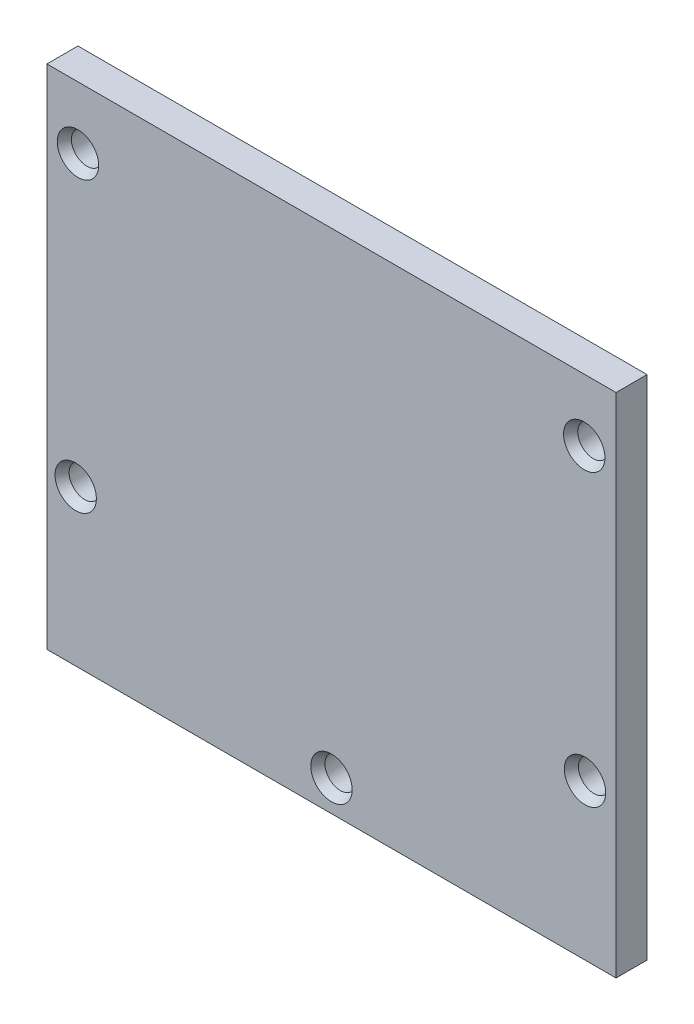
ISO-10303-21;
HEADER;
FILE_DESCRIPTION(('STEP AP214'),'2;1');
FILE_NAME('part.step','',(''),(''),'','','');
FILE_SCHEMA(('AUTOMOTIVE_DESIGN { 1 0 10303 214 1 1 1 1 }'));
ENDSEC;
DATA;
#1=APPLICATION_CONTEXT('core data for automotive mechanical design processes');
#2=APPLICATION_PROTOCOL_DEFINITION('international standard','automotive_design',2000,#1);
#3=PRODUCT_CONTEXT('',#1,'mechanical');
#4=PRODUCT('Part','Part','',(#3));
#5=PRODUCT_RELATED_PRODUCT_CATEGORY('part','',(#4));
#6=PRODUCT_DEFINITION_FORMATION('','',#4);
#7=PRODUCT_DEFINITION_CONTEXT('part definition',#1,'design');
#8=PRODUCT_DEFINITION('design','',#6,#7);
#9=PRODUCT_DEFINITION_SHAPE('','',#8);
#10=(LENGTH_UNIT() NAMED_UNIT(*) SI_UNIT(.MILLI.,.METRE.));
#11=(NAMED_UNIT(*) PLANE_ANGLE_UNIT() SI_UNIT($,.RADIAN.));
#12=(NAMED_UNIT(*) SI_UNIT($,.STERADIAN.) SOLID_ANGLE_UNIT());
#13=UNCERTAINTY_MEASURE_WITH_UNIT(LENGTH_MEASURE(1.E-05),#10,'distance_accuracy_value','');
#14=(GEOMETRIC_REPRESENTATION_CONTEXT(3) GLOBAL_UNCERTAINTY_ASSIGNED_CONTEXT((#13)) GLOBAL_UNIT_ASSIGNED_CONTEXT((#10,
#11,#12)) REPRESENTATION_CONTEXT('',''));
#15=CARTESIAN_POINT('',(0.,0.,0.));
#16=DIRECTION('',(0.,0.,1.));
#17=DIRECTION('',(1.,0.,0.));
#18=AXIS2_PLACEMENT_3D('',#15,#16,#17);
#19=CARTESIAN_POINT('',(0.,0.,3.));
#20=DIRECTION('',(0.,0.,-1.));
#21=DIRECTION('',(-1.,0.,0.));
#22=AXIS2_PLACEMENT_3D('',#19,#20,#21);
#23=PLANE('',#22);
#24=CARTESIAN_POINT('',(-24.7186538698167,-12.5,3.));
#25=DIRECTION('',(0.,0.,-1.));
#26=DIRECTION('',(-1.,0.,0.));
#27=AXIS2_PLACEMENT_3D('',#24,#25,#26);
#28=CIRCLE('',#27,1.99999999999999);
#29=CARTESIAN_POINT('',(-26.7186538698167,-12.5,3.));
#30=VERTEX_POINT('',#29);
#31=EDGE_CURVE('E128',#30,#30,#28,.T.);
#32=ORIENTED_EDGE('',*,*,#31,.T.);
#33=EDGE_LOOP('',(#32));
#34=FACE_BOUND('',#33,.T.);
#35=CARTESIAN_POINT('',(0.,-24.5,3.));
#36=DIRECTION('',(0.,0.,-1.));
#37=DIRECTION('',(-1.,0.,0.));
#38=AXIS2_PLACEMENT_3D('',#35,#36,#37);
#39=CIRCLE('',#38,1.99999999999999);
#40=CARTESIAN_POINT('',(-1.99999999999999,-24.5,3.));
#41=VERTEX_POINT('',#40);
#42=EDGE_CURVE('E125',#41,#41,#39,.T.);
#43=ORIENTED_EDGE('',*,*,#42,.T.);
#44=EDGE_LOOP('',(#43));
#45=FACE_BOUND('',#44,.T.);
#46=CARTESIAN_POINT('',(-24.5,15.5,3.));
#47=DIRECTION('',(0.,0.,-1.));
#48=DIRECTION('',(-1.,0.,0.));
#49=AXIS2_PLACEMENT_3D('',#46,#47,#48);
#50=CIRCLE('',#49,1.99999999999999);
#51=CARTESIAN_POINT('',(-26.5,15.5,3.));
#52=VERTEX_POINT('',#51);
#53=EDGE_CURVE('E122',#52,#52,#50,.T.);
#54=ORIENTED_EDGE('',*,*,#53,.T.);
#55=EDGE_LOOP('',(#54));
#56=FACE_BOUND('',#55,.T.);
#57=CARTESIAN_POINT('',(24.5,-12.5,3.));
#58=DIRECTION('',(0.,0.,-1.));
#59=DIRECTION('',(-1.,0.,0.));
#60=AXIS2_PLACEMENT_3D('',#57,#58,#59);
#61=CIRCLE('',#60,1.99999999999999);
#62=CARTESIAN_POINT('',(22.5,-12.5,3.));
#63=VERTEX_POINT('',#62);
#64=EDGE_CURVE('E119',#63,#63,#61,.T.);
#65=ORIENTED_EDGE('',*,*,#64,.T.);
#66=EDGE_LOOP('',(#65));
#67=FACE_BOUND('',#66,.T.);
#68=CARTESIAN_POINT('',(24.4303500117454,15.5,3.));
#69=DIRECTION('',(0.,0.,-1.));
#70=DIRECTION('',(-1.,0.,0.));
#71=AXIS2_PLACEMENT_3D('',#68,#69,#70);
#72=CIRCLE('',#71,1.99999999999999);
#73=CARTESIAN_POINT('',(22.4303500117454,15.5,3.));
#74=VERTEX_POINT('',#73);
#75=EDGE_CURVE('E116',#74,#74,#72,.T.);
#76=ORIENTED_EDGE('',*,*,#75,.T.);
#77=EDGE_LOOP('',(#76));
#78=FACE_BOUND('',#77,.T.);
#79=DIRECTION('',(0.,-1.,0.));
#80=VECTOR('',#79,1.);
#81=CARTESIAN_POINT('',(-27.5,-27.5,3.));
#82=LINE('',#81,#80);
#83=CARTESIAN_POINT('',(-27.5,21.5,3.));
#84=VERTEX_POINT('',#83);
#85=CARTESIAN_POINT('',(-27.5,-27.5,3.));
#86=VERTEX_POINT('',#85);
#87=EDGE_CURVE('E88',#84,#86,#82,.T.);
#88=ORIENTED_EDGE('',*,*,#87,.T.);
#89=DIRECTION('',(1.,0.,0.));
#90=VECTOR('',#89,1.);
#91=CARTESIAN_POINT('',(-27.5,-27.5,3.));
#92=LINE('',#91,#90);
#93=CARTESIAN_POINT('',(27.5,-27.5,3.));
#94=VERTEX_POINT('',#93);
#95=EDGE_CURVE('E84',#86,#94,#92,.T.);
#96=ORIENTED_EDGE('',*,*,#95,.T.);
#97=DIRECTION('',(0.,1.,0.));
#98=VECTOR('',#97,1.);
#99=CARTESIAN_POINT('',(27.5,-27.5,3.));
#100=LINE('',#99,#98);
#101=CARTESIAN_POINT('',(27.5,21.5,3.));
#102=VERTEX_POINT('',#101);
#103=EDGE_CURVE('E86',#94,#102,#100,.T.);
#104=ORIENTED_EDGE('',*,*,#103,.T.);
#105=DIRECTION('',(-1.,0.,0.));
#106=VECTOR('',#105,1.);
#107=CARTESIAN_POINT('',(-27.5,21.5,3.));
#108=LINE('',#107,#106);
#109=EDGE_CURVE('E53',#102,#84,#108,.T.);
#110=ORIENTED_EDGE('',*,*,#109,.T.);
#111=EDGE_LOOP('',(#88,#96,#104,#110));
#112=FACE_BOUND('',#111,.T.);
#113=ADVANCED_FACE('F35',(#34,#45,#56,#67,#78,#112),#23,.F.);
#114=CARTESIAN_POINT('',(0.,0.,0.));
#115=DIRECTION('',(0.,0.,-1.));
#116=DIRECTION('',(-1.,0.,0.));
#117=AXIS2_PLACEMENT_3D('',#114,#115,#116);
#118=PLANE('',#117);
#119=CARTESIAN_POINT('',(24.4303500117454,15.5,0.));
#120=DIRECTION('',(0.,0.,1.));
#121=DIRECTION('',(1.,0.,0.));
#122=AXIS2_PLACEMENT_3D('',#119,#120,#121);
#123=CIRCLE('',#122,1.5);
#124=CARTESIAN_POINT('',(25.9303500117454,15.5,0.));
#125=VERTEX_POINT('',#124);
#126=EDGE_CURVE('E215',#125,#125,#123,.T.);
#127=ORIENTED_EDGE('',*,*,#126,.T.);
#128=EDGE_LOOP('',(#127));
#129=FACE_BOUND('',#128,.T.);
#130=CARTESIAN_POINT('',(-24.7186538698167,-12.5,0.));
#131=DIRECTION('',(0.,0.,1.));
#132=DIRECTION('',(1.,0.,0.));
#133=AXIS2_PLACEMENT_3D('',#130,#131,#132);
#134=CIRCLE('',#133,1.5);
#135=CARTESIAN_POINT('',(-23.2186538698167,-12.5,0.));
#136=VERTEX_POINT('',#135);
#137=EDGE_CURVE('E223',#136,#136,#134,.T.);
#138=ORIENTED_EDGE('',*,*,#137,.T.);
#139=EDGE_LOOP('',(#138));
#140=FACE_BOUND('',#139,.T.);
#141=DIRECTION('',(0.,-1.,0.));
#142=VECTOR('',#141,1.);
#143=CARTESIAN_POINT('',(-27.5,-27.5,0.));
#144=LINE('',#143,#142);
#145=CARTESIAN_POINT('',(-27.5,21.5,0.));
#146=VERTEX_POINT('',#145);
#147=CARTESIAN_POINT('',(-27.5,-27.5,0.));
#148=VERTEX_POINT('',#147);
#149=EDGE_CURVE('E103',#146,#148,#144,.T.);
#150=ORIENTED_EDGE('',*,*,#149,.F.);
#151=DIRECTION('',(-1.,0.,0.));
#152=VECTOR('',#151,1.);
#153=CARTESIAN_POINT('',(-27.5,21.5,0.));
#154=LINE('',#153,#152);
#155=CARTESIAN_POINT('',(27.5,21.5,0.));
#156=VERTEX_POINT('',#155);
#157=EDGE_CURVE('E76',#156,#146,#154,.T.);
#158=ORIENTED_EDGE('',*,*,#157,.F.);
#159=DIRECTION('',(0.,1.,0.));
#160=VECTOR('',#159,1.);
#161=CARTESIAN_POINT('',(27.5,-27.5,0.));
#162=LINE('',#161,#160);
#163=CARTESIAN_POINT('',(27.5,-27.5,0.));
#164=VERTEX_POINT('',#163);
#165=EDGE_CURVE('E70',#164,#156,#162,.T.);
#166=ORIENTED_EDGE('',*,*,#165,.F.);
#167=DIRECTION('',(1.,0.,0.));
#168=VECTOR('',#167,1.);
#169=CARTESIAN_POINT('',(-27.5,-27.5,0.));
#170=LINE('',#169,#168);
#171=EDGE_CURVE('E93',#148,#164,#170,.T.);
#172=ORIENTED_EDGE('',*,*,#171,.F.);
#173=EDGE_LOOP('',(#150,#158,#166,#172));
#174=FACE_BOUND('',#173,.T.);
#175=CARTESIAN_POINT('',(-24.5,15.5,0.));
#176=DIRECTION('',(0.,0.,1.));
#177=DIRECTION('',(1.,0.,0.));
#178=AXIS2_PLACEMENT_3D('',#175,#176,#177);
#179=CIRCLE('',#178,1.5);
#180=CARTESIAN_POINT('',(-23.,15.5,0.));
#181=VERTEX_POINT('',#180);
#182=EDGE_CURVE('E106',#181,#181,#179,.T.);
#183=ORIENTED_EDGE('',*,*,#182,.T.);
#184=EDGE_LOOP('',(#183));
#185=FACE_BOUND('',#184,.T.);
#186=CARTESIAN_POINT('',(24.5,-12.5,0.));
#187=DIRECTION('',(0.,0.,1.));
#188=DIRECTION('',(1.,0.,0.));
#189=AXIS2_PLACEMENT_3D('',#186,#187,#188);
#190=CIRCLE('',#189,1.5);
#191=CARTESIAN_POINT('',(26.,-12.5,0.));
#192=VERTEX_POINT('',#191);
#193=EDGE_CURVE('E218',#192,#192,#190,.T.);
#194=ORIENTED_EDGE('',*,*,#193,.T.);
#195=EDGE_LOOP('',(#194));
#196=FACE_BOUND('',#195,.T.);
#197=CARTESIAN_POINT('',(0.,-24.5,0.));
#198=DIRECTION('',(0.,0.,1.));
#199=DIRECTION('',(1.,0.,0.));
#200=AXIS2_PLACEMENT_3D('',#197,#198,#199);
#201=CIRCLE('',#200,1.5);
#202=CARTESIAN_POINT('',(1.5,-24.5,0.));
#203=VERTEX_POINT('',#202);
#204=EDGE_CURVE('E213',#203,#203,#201,.T.);
#205=ORIENTED_EDGE('',*,*,#204,.T.);
#206=EDGE_LOOP('',(#205));
#207=FACE_BOUND('',#206,.T.);
#208=ADVANCED_FACE('F157',(#129,#140,#174,#185,#196,#207),#118,.T.);
#209=CARTESIAN_POINT('',(-27.5,-27.5,3.));
#210=DIRECTION('',(1.,0.,0.));
#211=DIRECTION('',(0.,0.,-1.));
#212=AXIS2_PLACEMENT_3D('',#209,#210,#211);
#213=PLANE('',#212);
#214=ORIENTED_EDGE('',*,*,#149,.T.);
#215=DIRECTION('',(0.,0.,-1.));
#216=VECTOR('',#215,1.);
#217=CARTESIAN_POINT('',(-27.5,-27.5,3.));
#218=LINE('',#217,#216);
#219=EDGE_CURVE('E94',#86,#148,#218,.T.);
#220=ORIENTED_EDGE('',*,*,#219,.F.);
#221=ORIENTED_EDGE('',*,*,#87,.F.);
#222=DIRECTION('',(0.,0.,-1.));
#223=VECTOR('',#222,1.);
#224=CARTESIAN_POINT('',(-27.5,21.5,3.));
#225=LINE('',#224,#223);
#226=EDGE_CURVE('E99',#84,#146,#225,.T.);
#227=ORIENTED_EDGE('',*,*,#226,.T.);
#228=EDGE_LOOP('',(#214,#220,#221,#227));
#229=FACE_BOUND('',#228,.T.);
#230=ADVANCED_FACE('F163',(#229),#213,.F.);
#231=CARTESIAN_POINT('',(-27.5,-27.5,3.));
#232=DIRECTION('',(0.,1.,0.));
#233=DIRECTION('',(0.,0.,1.));
#234=AXIS2_PLACEMENT_3D('',#231,#232,#233);
#235=PLANE('',#234);
#236=ORIENTED_EDGE('',*,*,#171,.T.);
#237=DIRECTION('',(0.,0.,-1.));
#238=VECTOR('',#237,1.);
#239=CARTESIAN_POINT('',(27.5,-27.5,3.));
#240=LINE('',#239,#238);
#241=EDGE_CURVE('E91',#94,#164,#240,.T.);
#242=ORIENTED_EDGE('',*,*,#241,.F.);
#243=ORIENTED_EDGE('',*,*,#95,.F.);
#244=ORIENTED_EDGE('',*,*,#219,.T.);
#245=EDGE_LOOP('',(#236,#242,#243,#244));
#246=FACE_BOUND('',#245,.T.);
#247=ADVANCED_FACE('F92',(#246),#235,.F.);
#248=CARTESIAN_POINT('',(27.5,-27.5,3.));
#249=DIRECTION('',(-1.,0.,0.));
#250=DIRECTION('',(0.,0.,1.));
#251=AXIS2_PLACEMENT_3D('',#248,#249,#250);
#252=PLANE('',#251);
#253=ORIENTED_EDGE('',*,*,#165,.T.);
#254=DIRECTION('',(0.,0.,-1.));
#255=VECTOR('',#254,1.);
#256=CARTESIAN_POINT('',(27.5,21.5,3.));
#257=LINE('',#256,#255);
#258=EDGE_CURVE('E95',#102,#156,#257,.T.);
#259=ORIENTED_EDGE('',*,*,#258,.F.);
#260=ORIENTED_EDGE('',*,*,#103,.F.);
#261=ORIENTED_EDGE('',*,*,#241,.T.);
#262=EDGE_LOOP('',(#253,#259,#260,#261));
#263=FACE_BOUND('',#262,.T.);
#264=ADVANCED_FACE('F97',(#263),#252,.F.);
#265=CARTESIAN_POINT('',(-27.5,21.5,3.));
#266=DIRECTION('',(0.,-1.,0.));
#267=DIRECTION('',(0.,0.,-1.));
#268=AXIS2_PLACEMENT_3D('',#265,#266,#267);
#269=PLANE('',#268);
#270=ORIENTED_EDGE('',*,*,#157,.T.);
#271=ORIENTED_EDGE('',*,*,#226,.F.);
#272=ORIENTED_EDGE('',*,*,#109,.F.);
#273=ORIENTED_EDGE('',*,*,#258,.T.);
#274=EDGE_LOOP('',(#270,#271,#272,#273));
#275=FACE_BOUND('',#274,.T.);
#276=ADVANCED_FACE('F171',(#275),#269,.F.);
#277=CARTESIAN_POINT('',(-24.5,15.5,3.));
#278=DIRECTION('',(0.,0.,-1.));
#279=DIRECTION('',(-1.,0.,0.));
#280=AXIS2_PLACEMENT_3D('',#277,#278,#279);
#281=CYLINDRICAL_SURFACE('',#280,1.5);
#282=CARTESIAN_POINT('',(-24.5,15.5,2.13397459621557));
#283=DIRECTION('',(0.,0.,-1.));
#284=DIRECTION('',(-1.,0.,0.));
#285=AXIS2_PLACEMENT_3D('',#282,#283,#284);
#286=CIRCLE('',#285,1.5);
#287=CARTESIAN_POINT('',(-26.,15.5,2.13397459621557));
#288=VERTEX_POINT('',#287);
#289=EDGE_CURVE('E134',#288,#288,#286,.F.);
#290=ORIENTED_EDGE('',*,*,#289,.T.);
#291=EDGE_LOOP('',(#290));
#292=FACE_BOUND('',#291,.T.);
#293=ORIENTED_EDGE('',*,*,#182,.F.);
#294=EDGE_LOOP('',(#293));
#295=FACE_BOUND('',#294,.T.);
#296=ADVANCED_FACE('F168',(#292,#295),#281,.F.);
#297=CARTESIAN_POINT('',(-24.7186538698167,-12.5,3.));
#298=DIRECTION('',(0.,0.,-1.));
#299=DIRECTION('',(-1.,0.,0.));
#300=AXIS2_PLACEMENT_3D('',#297,#298,#299);
#301=CYLINDRICAL_SURFACE('',#300,1.5);
#302=CARTESIAN_POINT('',(-24.7186538698167,-12.5,2.13397459621557));
#303=DIRECTION('',(0.,0.,-1.));
#304=DIRECTION('',(-1.,0.,0.));
#305=AXIS2_PLACEMENT_3D('',#302,#303,#304);
#306=CIRCLE('',#305,1.5);
#307=CARTESIAN_POINT('',(-26.2186538698167,-12.5,2.13397459621557));
#308=VERTEX_POINT('',#307);
#309=EDGE_CURVE('E113',#308,#308,#306,.F.);
#310=ORIENTED_EDGE('',*,*,#309,.T.);
#311=EDGE_LOOP('',(#310));
#312=FACE_BOUND('',#311,.T.);
#313=ORIENTED_EDGE('',*,*,#137,.F.);
#314=EDGE_LOOP('',(#313));
#315=FACE_BOUND('',#314,.T.);
#316=ADVANCED_FACE('F232',(#312,#315),#301,.F.);
#317=CARTESIAN_POINT('',(24.5,-12.5,3.));
#318=DIRECTION('',(0.,0.,-1.));
#319=DIRECTION('',(-1.,0.,0.));
#320=AXIS2_PLACEMENT_3D('',#317,#318,#319);
#321=CYLINDRICAL_SURFACE('',#320,1.5);
#322=CARTESIAN_POINT('',(24.5,-12.5,2.13397459621557));
#323=DIRECTION('',(0.,0.,-1.));
#324=DIRECTION('',(-1.,0.,0.));
#325=AXIS2_PLACEMENT_3D('',#322,#323,#324);
#326=CIRCLE('',#325,1.5);
#327=CARTESIAN_POINT('',(23.,-12.5,2.13397459621557));
#328=VERTEX_POINT('',#327);
#329=EDGE_CURVE('E45',#328,#328,#326,.F.);
#330=ORIENTED_EDGE('',*,*,#329,.T.);
#331=EDGE_LOOP('',(#330));
#332=FACE_BOUND('',#331,.T.);
#333=ORIENTED_EDGE('',*,*,#193,.F.);
#334=EDGE_LOOP('',(#333));
#335=FACE_BOUND('',#334,.T.);
#336=ADVANCED_FACE('F139',(#332,#335),#321,.F.);
#337=CARTESIAN_POINT('',(24.4303500117454,15.5,3.));
#338=DIRECTION('',(0.,0.,-1.));
#339=DIRECTION('',(-1.,0.,0.));
#340=AXIS2_PLACEMENT_3D('',#337,#338,#339);
#341=CYLINDRICAL_SURFACE('',#340,1.5);
#342=CARTESIAN_POINT('',(24.4303500117454,15.5,2.13397459621557));
#343=DIRECTION('',(0.,0.,-1.));
#344=DIRECTION('',(-1.,0.,0.));
#345=AXIS2_PLACEMENT_3D('',#342,#343,#344);
#346=CIRCLE('',#345,1.5);
#347=CARTESIAN_POINT('',(22.9303500117454,15.5,2.13397459621557));
#348=VERTEX_POINT('',#347);
#349=EDGE_CURVE('E11',#348,#348,#346,.F.);
#350=ORIENTED_EDGE('',*,*,#349,.T.);
#351=EDGE_LOOP('',(#350));
#352=FACE_BOUND('',#351,.T.);
#353=ORIENTED_EDGE('',*,*,#126,.F.);
#354=EDGE_LOOP('',(#353));
#355=FACE_BOUND('',#354,.T.);
#356=ADVANCED_FACE('F209',(#352,#355),#341,.F.);
#357=CARTESIAN_POINT('',(0.,-24.5,3.));
#358=DIRECTION('',(0.,0.,-1.));
#359=DIRECTION('',(-1.,0.,0.));
#360=AXIS2_PLACEMENT_3D('',#357,#358,#359);
#361=CYLINDRICAL_SURFACE('',#360,1.5);
#362=CARTESIAN_POINT('',(0.,-24.5,2.13397459621557));
#363=DIRECTION('',(0.,0.,-1.));
#364=DIRECTION('',(-1.,0.,0.));
#365=AXIS2_PLACEMENT_3D('',#362,#363,#364);
#366=CIRCLE('',#365,1.5);
#367=CARTESIAN_POINT('',(-1.5,-24.5,2.13397459621557));
#368=VERTEX_POINT('',#367);
#369=EDGE_CURVE('E131',#368,#368,#366,.F.);
#370=ORIENTED_EDGE('',*,*,#369,.T.);
#371=EDGE_LOOP('',(#370));
#372=FACE_BOUND('',#371,.T.);
#373=ORIENTED_EDGE('',*,*,#204,.F.);
#374=EDGE_LOOP('',(#373));
#375=FACE_BOUND('',#374,.T.);
#376=ADVANCED_FACE('F188',(#372,#375),#361,.F.);
#377=CARTESIAN_POINT('',(-24.7186538698167,-12.5,2.13397459621557));
#378=DIRECTION('',(0.,0.,1.));
#379=DIRECTION('',(1.,0.,0.));
#380=AXIS2_PLACEMENT_3D('',#377,#378,#379);
#381=CONICAL_SURFACE('',#380,1.5,0.523598775598296);
#382=ORIENTED_EDGE('',*,*,#31,.F.);
#383=EDGE_LOOP('',(#382));
#384=FACE_BOUND('',#383,.T.);
#385=ORIENTED_EDGE('',*,*,#309,.F.);
#386=EDGE_LOOP('',(#385));
#387=FACE_BOUND('',#386,.T.);
#388=ADVANCED_FACE('F182',(#384,#387),#381,.F.);
#389=CARTESIAN_POINT('',(0.,-24.5,2.13397459621557));
#390=DIRECTION('',(0.,0.,1.));
#391=DIRECTION('',(1.,0.,0.));
#392=AXIS2_PLACEMENT_3D('',#389,#390,#391);
#393=CONICAL_SURFACE('',#392,1.5,0.523598775598296);
#394=ORIENTED_EDGE('',*,*,#42,.F.);
#395=EDGE_LOOP('',(#394));
#396=FACE_BOUND('',#395,.T.);
#397=ORIENTED_EDGE('',*,*,#369,.F.);
#398=EDGE_LOOP('',(#397));
#399=FACE_BOUND('',#398,.T.);
#400=ADVANCED_FACE('F151',(#396,#399),#393,.F.);
#401=CARTESIAN_POINT('',(-24.5,15.5,2.13397459621557));
#402=DIRECTION('',(0.,0.,1.));
#403=DIRECTION('',(1.,0.,0.));
#404=AXIS2_PLACEMENT_3D('',#401,#402,#403);
#405=CONICAL_SURFACE('',#404,1.5,0.523598775598296);
#406=ORIENTED_EDGE('',*,*,#53,.F.);
#407=EDGE_LOOP('',(#406));
#408=FACE_BOUND('',#407,.T.);
#409=ORIENTED_EDGE('',*,*,#289,.F.);
#410=EDGE_LOOP('',(#409));
#411=FACE_BOUND('',#410,.T.);
#412=ADVANCED_FACE('F144',(#408,#411),#405,.F.);
#413=CARTESIAN_POINT('',(24.5,-12.5,2.13397459621557));
#414=DIRECTION('',(0.,0.,1.));
#415=DIRECTION('',(1.,0.,0.));
#416=AXIS2_PLACEMENT_3D('',#413,#414,#415);
#417=CONICAL_SURFACE('',#416,1.5,0.523598775598296);
#418=ORIENTED_EDGE('',*,*,#64,.F.);
#419=EDGE_LOOP('',(#418));
#420=FACE_BOUND('',#419,.T.);
#421=ORIENTED_EDGE('',*,*,#329,.F.);
#422=EDGE_LOOP('',(#421));
#423=FACE_BOUND('',#422,.T.);
#424=ADVANCED_FACE('F142',(#420,#423),#417,.F.);
#425=CARTESIAN_POINT('',(24.4303500117454,15.5,2.13397459621557));
#426=DIRECTION('',(0.,0.,1.));
#427=DIRECTION('',(1.,0.,0.));
#428=AXIS2_PLACEMENT_3D('',#425,#426,#427);
#429=CONICAL_SURFACE('',#428,1.5,0.523598775598296);
#430=ORIENTED_EDGE('',*,*,#75,.F.);
#431=EDGE_LOOP('',(#430));
#432=FACE_BOUND('',#431,.T.);
#433=ORIENTED_EDGE('',*,*,#349,.F.);
#434=EDGE_LOOP('',(#433));
#435=FACE_BOUND('',#434,.T.);
#436=ADVANCED_FACE('F38',(#432,#435),#429,.F.);
#437=CLOSED_SHELL('',(#113,#208,#230,#247,#264,#276,#296,#316,#336,#356,#376,#388,#400,#412,
#424,#436));
#438=MANIFOLD_SOLID_BREP('B2',#437);
#439=ADVANCED_BREP_SHAPE_REPRESENTATION('',(#18,#438),#14);
#440=SHAPE_DEFINITION_REPRESENTATION(#9,#439);
ENDSEC;
END-ISO-10303-21;
